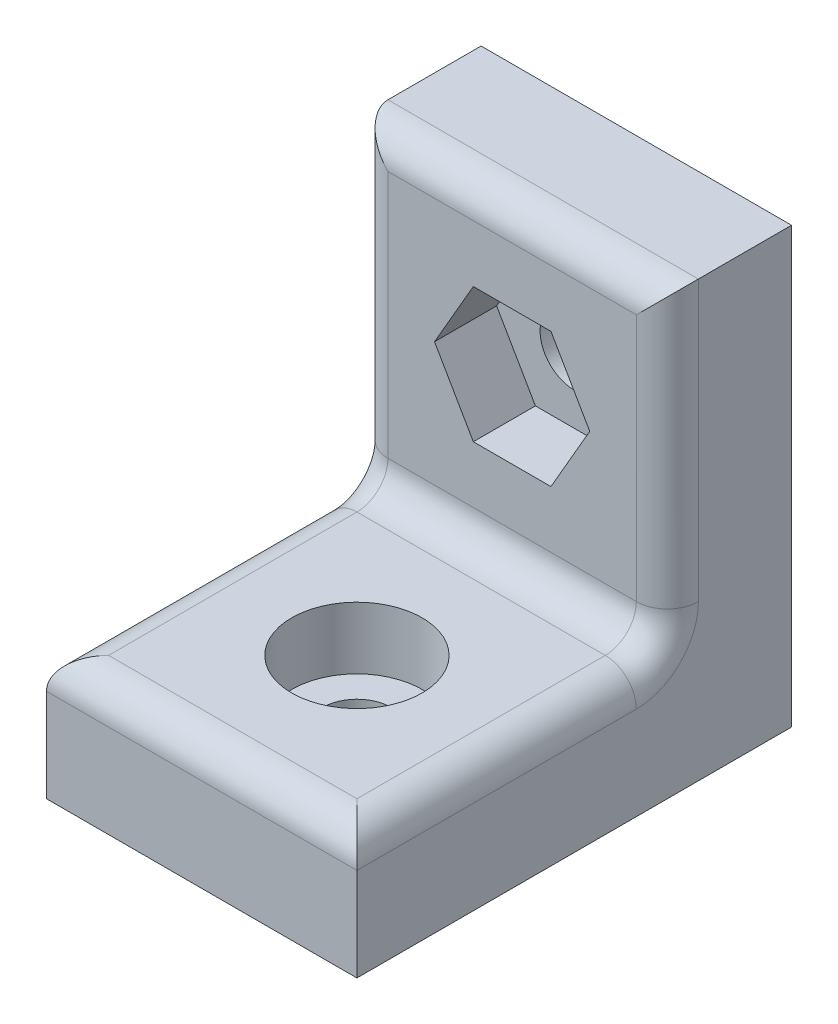
ISO-10303-21;
HEADER;
FILE_DESCRIPTION(('STEP AP214'),'2;1');
FILE_NAME('part.step','',(''),(''),'','','');
FILE_SCHEMA(('AUTOMOTIVE_DESIGN { 1 0 10303 214 1 1 1 1 }'));
ENDSEC;
DATA;
#1=APPLICATION_CONTEXT('core data for automotive mechanical design processes');
#2=APPLICATION_PROTOCOL_DEFINITION('international standard','automotive_design',2000,#1);
#3=PRODUCT_CONTEXT('',#1,'mechanical');
#4=PRODUCT('Part','Part','',(#3));
#5=PRODUCT_RELATED_PRODUCT_CATEGORY('part','',(#4));
#6=PRODUCT_DEFINITION_FORMATION('','',#4);
#7=PRODUCT_DEFINITION_CONTEXT('part definition',#1,'design');
#8=PRODUCT_DEFINITION('design','',#6,#7);
#9=PRODUCT_DEFINITION_SHAPE('','',#8);
#10=(LENGTH_UNIT() NAMED_UNIT(*) SI_UNIT(.MILLI.,.METRE.));
#11=(NAMED_UNIT(*) PLANE_ANGLE_UNIT() SI_UNIT($,.RADIAN.));
#12=(NAMED_UNIT(*) SI_UNIT($,.STERADIAN.) SOLID_ANGLE_UNIT());
#13=UNCERTAINTY_MEASURE_WITH_UNIT(LENGTH_MEASURE(1.E-05),#10,'distance_accuracy_value','');
#14=(GEOMETRIC_REPRESENTATION_CONTEXT(3) GLOBAL_UNCERTAINTY_ASSIGNED_CONTEXT((#13)) GLOBAL_UNIT_ASSIGNED_CONTEXT((#10,
#11,#12)) REPRESENTATION_CONTEXT('',''));
#15=CARTESIAN_POINT('',(0.,0.,0.));
#16=DIRECTION('',(0.,0.,1.));
#17=DIRECTION('',(1.,0.,0.));
#18=AXIS2_PLACEMENT_3D('',#15,#16,#17);
#19=CARTESIAN_POINT('',(0.,0.,9.));
#20=DIRECTION('',(0.,1.,0.));
#21=DIRECTION('',(0.,0.,1.));
#22=AXIS2_PLACEMENT_3D('',#19,#20,#21);
#23=CYLINDRICAL_SURFACE('',#22,1.1);
#24=CARTESIAN_POINT('',(0.,0.,9.));
#25=DIRECTION('',(0.,1.,0.));
#26=DIRECTION('',(0.,0.,1.));
#27=AXIS2_PLACEMENT_3D('',#24,#25,#26);
#28=CIRCLE('',#27,1.1);
#29=CARTESIAN_POINT('',(0.,0.,10.1));
#30=VERTEX_POINT('',#29);
#31=EDGE_CURVE('E220',#30,#30,#28,.T.);
#32=ORIENTED_EDGE('',*,*,#31,.F.);
#33=EDGE_LOOP('',(#32));
#34=FACE_BOUND('',#33,.T.);
#35=CARTESIAN_POINT('',(0.,2.,9.));
#36=DIRECTION('',(0.,1.,0.));
#37=DIRECTION('',(0.,0.,1.));
#38=AXIS2_PLACEMENT_3D('',#35,#36,#37);
#39=CIRCLE('',#38,1.1);
#40=CARTESIAN_POINT('',(0.,2.,10.1));
#41=VERTEX_POINT('',#40);
#42=EDGE_CURVE('E44',#41,#41,#39,.F.);
#43=ORIENTED_EDGE('',*,*,#42,.F.);
#44=EDGE_LOOP('',(#43));
#45=FACE_BOUND('',#44,.T.);
#46=ADVANCED_FACE('F40',(#34,#45),#23,.F.);
#47=CARTESIAN_POINT('',(0.,9.,0.));
#48=DIRECTION('',(0.,0.,1.));
#49=DIRECTION('',(1.,0.,0.));
#50=AXIS2_PLACEMENT_3D('',#47,#48,#49);
#51=CYLINDRICAL_SURFACE('',#50,1.1);
#52=CARTESIAN_POINT('',(0.,9.,0.));
#53=DIRECTION('',(0.,0.,1.));
#54=DIRECTION('',(1.,0.,0.));
#55=AXIS2_PLACEMENT_3D('',#52,#53,#54);
#56=CIRCLE('',#55,1.1);
#57=CARTESIAN_POINT('',(1.1,9.,0.));
#58=VERTEX_POINT('',#57);
#59=EDGE_CURVE('E224',#58,#58,#56,.T.);
#60=ORIENTED_EDGE('',*,*,#59,.F.);
#61=EDGE_LOOP('',(#60));
#62=FACE_BOUND('',#61,.T.);
#63=CARTESIAN_POINT('',(0.,9.,2.));
#64=DIRECTION('',(0.,0.,1.));
#65=DIRECTION('',(1.,0.,0.));
#66=AXIS2_PLACEMENT_3D('',#63,#64,#65);
#67=CIRCLE('',#66,1.1);
#68=CARTESIAN_POINT('',(1.1,9.,2.));
#69=VERTEX_POINT('',#68);
#70=EDGE_CURVE('E212',#69,#69,#67,.F.);
#71=ORIENTED_EDGE('',*,*,#70,.F.);
#72=EDGE_LOOP('',(#71));
#73=FACE_BOUND('',#72,.T.);
#74=ADVANCED_FACE('F317',(#62,#73),#51,.F.);
#75=CARTESIAN_POINT('',(-5.,14.,4.));
#76=DIRECTION('',(1.,0.,0.));
#77=DIRECTION('',(0.,1.,0.));
#78=AXIS2_PLACEMENT_3D('',#75,#76,#77);
#79=PLANE('',#78);
#80=CARTESIAN_POINT('',(-5.,5.,5.));
#81=DIRECTION('',(1.,0.,0.));
#82=DIRECTION('',(0.,1.,0.));
#83=AXIS2_PLACEMENT_3D('',#80,#81,#82);
#84=CIRCLE('',#83,2.);
#85=CARTESIAN_POINT('',(-5.,5.,3.));
#86=VERTEX_POINT('',#85);
#87=CARTESIAN_POINT('',(-5.,3.,5.));
#88=VERTEX_POINT('',#87);
#89=EDGE_CURVE('E274',#86,#88,#84,.F.);
#90=ORIENTED_EDGE('',*,*,#89,.F.);
#91=DIRECTION('',(0.,-1.,0.));
#92=VECTOR('',#91,1.);
#93=CARTESIAN_POINT('',(-5.,14.,3.));
#94=LINE('',#93,#92);
#95=CARTESIAN_POINT('',(-5.,14.,3.));
#96=VERTEX_POINT('',#95);
#97=EDGE_CURVE('E279',#86,#96,#94,.F.);
#98=ORIENTED_EDGE('',*,*,#97,.T.);
#99=DIRECTION('',(0.,0.,-1.));
#100=VECTOR('',#99,1.);
#101=CARTESIAN_POINT('',(-5.,14.,4.));
#102=LINE('',#101,#100);
#103=CARTESIAN_POINT('',(-5.,14.,0.));
#104=VERTEX_POINT('',#103);
#105=EDGE_CURVE('E247',#96,#104,#102,.T.);
#106=ORIENTED_EDGE('',*,*,#105,.T.);
#107=DIRECTION('',(0.,-1.,0.));
#108=VECTOR('',#107,1.);
#109=CARTESIAN_POINT('',(-5.,14.,0.));
#110=LINE('',#109,#108);
#111=CARTESIAN_POINT('',(-5.,0.,0.));
#112=VERTEX_POINT('',#111);
#113=EDGE_CURVE('E236',#104,#112,#110,.T.);
#114=ORIENTED_EDGE('',*,*,#113,.T.);
#115=DIRECTION('',(0.,0.,-1.));
#116=VECTOR('',#115,1.);
#117=CARTESIAN_POINT('',(-5.,0.,4.));
#118=LINE('',#117,#116);
#119=CARTESIAN_POINT('',(-5.,0.,14.));
#120=VERTEX_POINT('',#119);
#121=EDGE_CURVE('E254',#120,#112,#118,.T.);
#122=ORIENTED_EDGE('',*,*,#121,.F.);
#123=DIRECTION('',(0.,-1.,0.));
#124=VECTOR('',#123,1.);
#125=CARTESIAN_POINT('',(-5.,0.,14.));
#126=LINE('',#125,#124);
#127=CARTESIAN_POINT('',(-5.,3.,14.));
#128=VERTEX_POINT('',#127);
#129=EDGE_CURVE('E227',#128,#120,#126,.T.);
#130=ORIENTED_EDGE('',*,*,#129,.F.);
#131=DIRECTION('',(0.,0.,-1.));
#132=VECTOR('',#131,1.);
#133=CARTESIAN_POINT('',(-5.,3.,4.));
#134=LINE('',#133,#132);
#135=EDGE_CURVE('E277',#128,#88,#134,.T.);
#136=ORIENTED_EDGE('',*,*,#135,.T.);
#137=EDGE_LOOP('',(#90,#98,#106,#114,#122,#130,#136));
#138=FACE_BOUND('',#137,.T.);
#139=ADVANCED_FACE('F319',(#138),#79,.F.);
#140=CARTESIAN_POINT('',(-5.,0.,4.));
#141=DIRECTION('',(0.,1.,0.));
#142=DIRECTION('',(0.,0.,1.));
#143=AXIS2_PLACEMENT_3D('',#140,#141,#142);
#144=PLANE('',#143);
#145=ORIENTED_EDGE('',*,*,#31,.T.);
#146=EDGE_LOOP('',(#145));
#147=FACE_BOUND('',#146,.T.);
#148=DIRECTION('',(1.,0.,0.));
#149=VECTOR('',#148,1.);
#150=CARTESIAN_POINT('',(-5.,0.,0.));
#151=LINE('',#150,#149);
#152=CARTESIAN_POINT('',(5.,0.,0.));
#153=VERTEX_POINT('',#152);
#154=EDGE_CURVE('E239',#112,#153,#151,.T.);
#155=ORIENTED_EDGE('',*,*,#154,.T.);
#156=DIRECTION('',(0.,0.,-1.));
#157=VECTOR('',#156,1.);
#158=CARTESIAN_POINT('',(5.,0.,4.));
#159=LINE('',#158,#157);
#160=CARTESIAN_POINT('',(5.,0.,14.));
#161=VERTEX_POINT('',#160);
#162=EDGE_CURVE('E251',#161,#153,#159,.T.);
#163=ORIENTED_EDGE('',*,*,#162,.F.);
#164=DIRECTION('',(1.,0.,0.));
#165=VECTOR('',#164,1.);
#166=CARTESIAN_POINT('',(-5.,0.,14.));
#167=LINE('',#166,#165);
#168=EDGE_CURVE('E230',#120,#161,#167,.T.);
#169=ORIENTED_EDGE('',*,*,#168,.F.);
#170=ORIENTED_EDGE('',*,*,#121,.T.);
#171=EDGE_LOOP('',(#155,#163,#169,#170));
#172=FACE_BOUND('',#171,.T.);
#173=ADVANCED_FACE('F326',(#147,#172),#144,.F.);
#174=CARTESIAN_POINT('',(5.,14.,4.));
#175=DIRECTION('',(-1.,0.,0.));
#176=DIRECTION('',(0.,-1.,0.));
#177=AXIS2_PLACEMENT_3D('',#174,#175,#176);
#178=PLANE('',#177);
#179=DIRECTION('',(0.,0.,-1.));
#180=VECTOR('',#179,1.);
#181=CARTESIAN_POINT('',(5.,14.,4.));
#182=LINE('',#181,#180);
#183=CARTESIAN_POINT('',(5.,14.,3.));
#184=VERTEX_POINT('',#183);
#185=CARTESIAN_POINT('',(5.,14.,0.));
#186=VERTEX_POINT('',#185);
#187=EDGE_CURVE('E249',#184,#186,#182,.T.);
#188=ORIENTED_EDGE('',*,*,#187,.F.);
#189=DIRECTION('',(0.,1.,0.));
#190=VECTOR('',#189,1.);
#191=CARTESIAN_POINT('',(5.,4.,3.));
#192=LINE('',#191,#190);
#193=CARTESIAN_POINT('',(5.,5.,3.));
#194=VERTEX_POINT('',#193);
#195=EDGE_CURVE('E271',#184,#194,#192,.F.);
#196=ORIENTED_EDGE('',*,*,#195,.T.);
#197=CARTESIAN_POINT('',(5.,5.,5.));
#198=DIRECTION('',(-1.,0.,0.));
#199=DIRECTION('',(0.,-1.,0.));
#200=AXIS2_PLACEMENT_3D('',#197,#198,#199);
#201=CIRCLE('',#200,2.);
#202=CARTESIAN_POINT('',(5.,3.,5.));
#203=VERTEX_POINT('',#202);
#204=EDGE_CURVE('E268',#203,#194,#201,.F.);
#205=ORIENTED_EDGE('',*,*,#204,.F.);
#206=DIRECTION('',(0.,0.,-1.));
#207=VECTOR('',#206,1.);
#208=CARTESIAN_POINT('',(5.,3.,4.));
#209=LINE('',#208,#207);
#210=CARTESIAN_POINT('',(5.,3.,14.));
#211=VERTEX_POINT('',#210);
#212=EDGE_CURVE('E266',#203,#211,#209,.F.);
#213=ORIENTED_EDGE('',*,*,#212,.T.);
#214=DIRECTION('',(0.,1.,0.));
#215=VECTOR('',#214,1.);
#216=CARTESIAN_POINT('',(5.,0.,14.));
#217=LINE('',#216,#215);
#218=EDGE_CURVE('E233',#161,#211,#217,.T.);
#219=ORIENTED_EDGE('',*,*,#218,.F.);
#220=ORIENTED_EDGE('',*,*,#162,.T.);
#221=DIRECTION('',(0.,1.,0.));
#222=VECTOR('',#221,1.);
#223=CARTESIAN_POINT('',(5.,14.,0.));
#224=LINE('',#223,#222);
#225=EDGE_CURVE('E241',#153,#186,#224,.T.);
#226=ORIENTED_EDGE('',*,*,#225,.T.);
#227=EDGE_LOOP('',(#188,#196,#205,#213,#219,#220,#226));
#228=FACE_BOUND('',#227,.T.);
#229=ADVANCED_FACE('F353',(#228),#178,.F.);
#230=CARTESIAN_POINT('',(-5.,14.,4.));
#231=DIRECTION('',(0.,-1.,0.));
#232=DIRECTION('',(0.,0.,-1.));
#233=AXIS2_PLACEMENT_3D('',#230,#231,#232);
#234=PLANE('',#233);
#235=ORIENTED_EDGE('',*,*,#105,.F.);
#236=DIRECTION('',(-1.,0.,0.));
#237=VECTOR('',#236,1.);
#238=CARTESIAN_POINT('',(5.,14.,3.));
#239=LINE('',#238,#237);
#240=EDGE_CURVE('E281',#96,#184,#239,.F.);
#241=ORIENTED_EDGE('',*,*,#240,.T.);
#242=ORIENTED_EDGE('',*,*,#187,.T.);
#243=DIRECTION('',(-1.,0.,0.));
#244=VECTOR('',#243,1.);
#245=CARTESIAN_POINT('',(-5.,14.,0.));
#246=LINE('',#245,#244);
#247=EDGE_CURVE('E244',#186,#104,#246,.T.);
#248=ORIENTED_EDGE('',*,*,#247,.T.);
#249=EDGE_LOOP('',(#235,#241,#242,#248));
#250=FACE_BOUND('',#249,.T.);
#251=ADVANCED_FACE('F346',(#250),#234,.F.);
#252=CARTESIAN_POINT('',(0.,0.,4.));
#253=DIRECTION('',(0.,0.,1.));
#254=DIRECTION('',(1.,0.,0.));
#255=AXIS2_PLACEMENT_3D('',#252,#253,#254);
#256=PLANE('',#255);
#257=DIRECTION('',(1.,0.,0.));
#258=VECTOR('',#257,1.);
#259=CARTESIAN_POINT('',(-1.25,6.8349364905389,4.));
#260=LINE('',#259,#258);
#261=CARTESIAN_POINT('',(-1.25,6.8349364905389,4.));
#262=VERTEX_POINT('',#261);
#263=CARTESIAN_POINT('',(1.25,6.83493649053891,4.));
#264=VERTEX_POINT('',#263);
#265=EDGE_CURVE('E57',#262,#264,#260,.T.);
#266=ORIENTED_EDGE('',*,*,#265,.F.);
#267=DIRECTION('',(0.5,-0.866025403784439,0.));
#268=VECTOR('',#267,1.);
#269=CARTESIAN_POINT('',(-2.5,9.,4.));
#270=LINE('',#269,#268);
#271=CARTESIAN_POINT('',(-2.5,9.,4.));
#272=VERTEX_POINT('',#271);
#273=EDGE_CURVE('E183',#272,#262,#270,.T.);
#274=ORIENTED_EDGE('',*,*,#273,.F.);
#275=DIRECTION('',(-0.5,-0.866025403784438,0.));
#276=VECTOR('',#275,1.);
#277=CARTESIAN_POINT('',(-1.25,11.1650635094611,4.));
#278=LINE('',#277,#276);
#279=CARTESIAN_POINT('',(-1.25,11.1650635094611,4.));
#280=VERTEX_POINT('',#279);
#281=EDGE_CURVE('E186',#280,#272,#278,.T.);
#282=ORIENTED_EDGE('',*,*,#281,.F.);
#283=DIRECTION('',(-1.,0.,0.));
#284=VECTOR('',#283,1.);
#285=CARTESIAN_POINT('',(1.25,11.1650635094611,4.));
#286=LINE('',#285,#284);
#287=CARTESIAN_POINT('',(1.25,11.1650635094611,4.));
#288=VERTEX_POINT('',#287);
#289=EDGE_CURVE('E205',#288,#280,#286,.T.);
#290=ORIENTED_EDGE('',*,*,#289,.F.);
#291=DIRECTION('',(-0.5,0.866025403784439,0.));
#292=VECTOR('',#291,1.);
#293=CARTESIAN_POINT('',(2.5,9.,4.));
#294=LINE('',#293,#292);
#295=CARTESIAN_POINT('',(2.5,9.,4.));
#296=VERTEX_POINT('',#295);
#297=EDGE_CURVE('E202',#296,#288,#294,.T.);
#298=ORIENTED_EDGE('',*,*,#297,.F.);
#299=DIRECTION('',(0.5,0.866025403784439,0.));
#300=VECTOR('',#299,1.);
#301=CARTESIAN_POINT('',(1.25,6.8349364905389,4.));
#302=LINE('',#301,#300);
#303=EDGE_CURVE('E200',#264,#296,#302,.T.);
#304=ORIENTED_EDGE('',*,*,#303,.F.);
#305=EDGE_LOOP('',(#266,#274,#282,#290,#298,#304));
#306=FACE_BOUND('',#305,.T.);
#307=DIRECTION('',(0.,1.,0.));
#308=VECTOR('',#307,1.);
#309=CARTESIAN_POINT('',(4.,14.,4.));
#310=LINE('',#309,#308);
#311=CARTESIAN_POINT('',(4.,5.,4.));
#312=VERTEX_POINT('',#311);
#313=CARTESIAN_POINT('',(4.,13.,4.));
#314=VERTEX_POINT('',#313);
#315=EDGE_CURVE('E261',#312,#314,#310,.T.);
#316=ORIENTED_EDGE('',*,*,#315,.T.);
#317=DIRECTION('',(-1.,0.,0.));
#318=VECTOR('',#317,1.);
#319=CARTESIAN_POINT('',(-5.,13.,4.));
#320=LINE('',#319,#318);
#321=CARTESIAN_POINT('',(-4.,13.,4.));
#322=VERTEX_POINT('',#321);
#323=EDGE_CURVE('E264',#314,#322,#320,.T.);
#324=ORIENTED_EDGE('',*,*,#323,.T.);
#325=DIRECTION('',(0.,-1.,0.));
#326=VECTOR('',#325,1.);
#327=CARTESIAN_POINT('',(-4.,4.,4.));
#328=LINE('',#327,#326);
#329=CARTESIAN_POINT('',(-4.,5.,4.));
#330=VERTEX_POINT('',#329);
#331=EDGE_CURVE('E259',#322,#330,#328,.T.);
#332=ORIENTED_EDGE('',*,*,#331,.T.);
#333=DIRECTION('',(-1.,0.,0.));
#334=VECTOR('',#333,1.);
#335=CARTESIAN_POINT('',(0.,5.,4.));
#336=LINE('',#335,#334);
#337=EDGE_CURVE('E257',#330,#312,#336,.F.);
#338=ORIENTED_EDGE('',*,*,#337,.T.);
#339=EDGE_LOOP('',(#316,#324,#332,#338));
#340=FACE_BOUND('',#339,.T.);
#341=ADVANCED_FACE('F343',(#306,#340),#256,.T.);
#342=CARTESIAN_POINT('',(0.,0.,0.));
#343=DIRECTION('',(0.,0.,1.));
#344=DIRECTION('',(1.,0.,0.));
#345=AXIS2_PLACEMENT_3D('',#342,#343,#344);
#346=PLANE('',#345);
#347=ORIENTED_EDGE('',*,*,#59,.T.);
#348=EDGE_LOOP('',(#347));
#349=FACE_BOUND('',#348,.T.);
#350=ORIENTED_EDGE('',*,*,#113,.F.);
#351=ORIENTED_EDGE('',*,*,#247,.F.);
#352=ORIENTED_EDGE('',*,*,#225,.F.);
#353=ORIENTED_EDGE('',*,*,#154,.F.);
#354=EDGE_LOOP('',(#350,#351,#352,#353));
#355=FACE_BOUND('',#354,.T.);
#356=ADVANCED_FACE('F341',(#349,#355),#346,.F.);
#357=CARTESIAN_POINT('',(-5.,4.,14.));
#358=DIRECTION('',(0.,-1.,0.));
#359=DIRECTION('',(0.,0.,-1.));
#360=AXIS2_PLACEMENT_3D('',#357,#358,#359);
#361=PLANE('',#360);
#362=CARTESIAN_POINT('',(0.,4.,9.));
#363=DIRECTION('',(0.,1.,0.));
#364=DIRECTION('',(0.,0.,1.));
#365=AXIS2_PLACEMENT_3D('',#362,#363,#364);
#366=CIRCLE('',#365,2.1);
#367=CARTESIAN_POINT('',(0.,4.,11.1));
#368=VERTEX_POINT('',#367);
#369=EDGE_CURVE('E189',#368,#368,#366,.T.);
#370=ORIENTED_EDGE('',*,*,#369,.F.);
#371=EDGE_LOOP('',(#370));
#372=FACE_BOUND('',#371,.T.);
#373=DIRECTION('',(0.,0.,-1.));
#374=VECTOR('',#373,1.);
#375=CARTESIAN_POINT('',(-4.,4.,14.));
#376=LINE('',#375,#374);
#377=CARTESIAN_POINT('',(-4.,4.,5.));
#378=VERTEX_POINT('',#377);
#379=CARTESIAN_POINT('',(-4.,4.,13.));
#380=VERTEX_POINT('',#379);
#381=EDGE_CURVE('E287',#378,#380,#376,.F.);
#382=ORIENTED_EDGE('',*,*,#381,.T.);
#383=DIRECTION('',(-1.,0.,0.));
#384=VECTOR('',#383,1.);
#385=CARTESIAN_POINT('',(-5.,4.,13.));
#386=LINE('',#385,#384);
#387=CARTESIAN_POINT('',(4.,4.,13.));
#388=VERTEX_POINT('',#387);
#389=EDGE_CURVE('E12',#380,#388,#386,.F.);
#390=ORIENTED_EDGE('',*,*,#389,.T.);
#391=DIRECTION('',(0.,0.,-1.));
#392=VECTOR('',#391,1.);
#393=CARTESIAN_POINT('',(4.,4.,14.));
#394=LINE('',#393,#392);
#395=CARTESIAN_POINT('',(4.,4.,5.));
#396=VERTEX_POINT('',#395);
#397=EDGE_CURVE('E49',#388,#396,#394,.T.);
#398=ORIENTED_EDGE('',*,*,#397,.T.);
#399=DIRECTION('',(-1.,0.,0.));
#400=VECTOR('',#399,1.);
#401=CARTESIAN_POINT('',(-5.,4.,5.));
#402=LINE('',#401,#400);
#403=EDGE_CURVE('E285',#396,#378,#402,.T.);
#404=ORIENTED_EDGE('',*,*,#403,.T.);
#405=EDGE_LOOP('',(#382,#390,#398,#404));
#406=FACE_BOUND('',#405,.T.);
#407=ADVANCED_FACE('F337',(#372,#406),#361,.F.);
#408=CARTESIAN_POINT('',(0.,0.,14.));
#409=DIRECTION('',(0.,0.,-1.));
#410=DIRECTION('',(-1.,0.,0.));
#411=AXIS2_PLACEMENT_3D('',#408,#409,#410);
#412=PLANE('',#411);
#413=ORIENTED_EDGE('',*,*,#218,.T.);
#414=DIRECTION('',(-1.,0.,0.));
#415=VECTOR('',#414,1.);
#416=CARTESIAN_POINT('',(0.,3.,14.));
#417=LINE('',#416,#415);
#418=EDGE_CURVE('E283',#211,#128,#417,.T.);
#419=ORIENTED_EDGE('',*,*,#418,.T.);
#420=ORIENTED_EDGE('',*,*,#129,.T.);
#421=ORIENTED_EDGE('',*,*,#168,.T.);
#422=EDGE_LOOP('',(#413,#419,#420,#421));
#423=FACE_BOUND('',#422,.T.);
#424=ADVANCED_FACE('F334',(#423),#412,.F.);
#425=CARTESIAN_POINT('',(-4.,3.,4.));
#426=DIRECTION('',(0.,0.,-1.));
#427=DIRECTION('',(-1.,0.,0.));
#428=AXIS2_PLACEMENT_3D('',#425,#426,#427);
#429=CYLINDRICAL_SURFACE('',#428,1.);
#430=CARTESIAN_POINT('',(-4.,3.,5.));
#431=DIRECTION('',(0.,0.,-1.));
#432=DIRECTION('',(-1.,0.,0.));
#433=AXIS2_PLACEMENT_3D('',#430,#431,#432);
#434=CIRCLE('',#433,1.);
#435=EDGE_CURVE('E310',#88,#378,#434,.T.);
#436=ORIENTED_EDGE('',*,*,#435,.F.);
#437=ORIENTED_EDGE('',*,*,#135,.F.);
#438=CARTESIAN_POINT('',(-4.,3.,13.));
#439=DIRECTION('',(-0.707106781186547,0.,-0.707106781186547));
#440=DIRECTION('',(0.707106781186547,0.,-0.707106781186547));
#441=AXIS2_PLACEMENT_3D('',#438,#439,#440);
#442=ELLIPSE('',#441,1.41421356237309,1.);
#443=EDGE_CURVE('E228',#380,#128,#442,.F.);
#444=ORIENTED_EDGE('',*,*,#443,.F.);
#445=ORIENTED_EDGE('',*,*,#381,.F.);
#446=EDGE_LOOP('',(#436,#437,#444,#445));
#447=FACE_BOUND('',#446,.T.);
#448=ADVANCED_FACE('F42',(#447),#429,.T.);
#449=CARTESIAN_POINT('',(0.,3.,13.));
#450=DIRECTION('',(-1.,0.,0.));
#451=DIRECTION('',(0.,0.,1.));
#452=AXIS2_PLACEMENT_3D('',#449,#450,#451);
#453=CYLINDRICAL_SURFACE('',#452,1.);
#454=ORIENTED_EDGE('',*,*,#443,.T.);
#455=ORIENTED_EDGE('',*,*,#418,.F.);
#456=CARTESIAN_POINT('',(4.,3.,13.));
#457=DIRECTION('',(0.707106781186547,0.,-0.707106781186547));
#458=DIRECTION('',(-0.707106781186547,0.,-0.707106781186547));
#459=AXIS2_PLACEMENT_3D('',#456,#457,#458);
#460=ELLIPSE('',#459,1.41421356237309,1.);
#461=EDGE_CURVE('E308',#388,#211,#460,.T.);
#462=ORIENTED_EDGE('',*,*,#461,.F.);
#463=ORIENTED_EDGE('',*,*,#389,.F.);
#464=EDGE_LOOP('',(#454,#455,#462,#463));
#465=FACE_BOUND('',#464,.T.);
#466=ADVANCED_FACE('F386',(#465),#453,.T.);
#467=CARTESIAN_POINT('',(-4.,5.,5.));
#468=DIRECTION('',(1.,0.,0.));
#469=DIRECTION('',(0.,1.,0.));
#470=AXIS2_PLACEMENT_3D('',#467,#468,#469);
#471=TOROIDAL_SURFACE('',#470,2.,1.);
#472=ORIENTED_EDGE('',*,*,#89,.T.);
#473=ORIENTED_EDGE('',*,*,#435,.T.);
#474=CARTESIAN_POINT('',(-4.,5.,5.));
#475=DIRECTION('',(1.,0.,0.));
#476=DIRECTION('',(0.,1.,0.));
#477=AXIS2_PLACEMENT_3D('',#474,#475,#476);
#478=CIRCLE('',#477,1.);
#479=EDGE_CURVE('E305',#330,#378,#478,.F.);
#480=ORIENTED_EDGE('',*,*,#479,.F.);
#481=CARTESIAN_POINT('',(-4.,5.,3.));
#482=DIRECTION('',(0.,-1.,0.));
#483=DIRECTION('',(0.,0.,-1.));
#484=AXIS2_PLACEMENT_3D('',#481,#482,#483);
#485=CIRCLE('',#484,1.);
#486=EDGE_CURVE('E302',#86,#330,#485,.F.);
#487=ORIENTED_EDGE('',*,*,#486,.F.);
#488=EDGE_LOOP('',(#472,#473,#480,#487));
#489=FACE_BOUND('',#488,.T.);
#490=ADVANCED_FACE('F384',(#489),#471,.T.);
#491=CARTESIAN_POINT('',(4.,3.,14.));
#492=DIRECTION('',(0.,0.,-1.));
#493=DIRECTION('',(-1.,0.,0.));
#494=AXIS2_PLACEMENT_3D('',#491,#492,#493);
#495=CYLINDRICAL_SURFACE('',#494,1.);
#496=ORIENTED_EDGE('',*,*,#461,.T.);
#497=ORIENTED_EDGE('',*,*,#212,.F.);
#498=CARTESIAN_POINT('',(4.,3.,5.));
#499=DIRECTION('',(0.,0.,-1.));
#500=DIRECTION('',(-1.,0.,0.));
#501=AXIS2_PLACEMENT_3D('',#498,#499,#500);
#502=CIRCLE('',#501,1.);
#503=EDGE_CURVE('E299',#396,#203,#502,.T.);
#504=ORIENTED_EDGE('',*,*,#503,.F.);
#505=ORIENTED_EDGE('',*,*,#397,.F.);
#506=EDGE_LOOP('',(#496,#497,#504,#505));
#507=FACE_BOUND('',#506,.T.);
#508=ADVANCED_FACE('F380',(#507),#495,.T.);
#509=CARTESIAN_POINT('',(-5.,5.,5.));
#510=DIRECTION('',(-1.,0.,0.));
#511=DIRECTION('',(0.,0.,1.));
#512=AXIS2_PLACEMENT_3D('',#509,#510,#511);
#513=CYLINDRICAL_SURFACE('',#512,1.);
#514=ORIENTED_EDGE('',*,*,#479,.T.);
#515=ORIENTED_EDGE('',*,*,#403,.F.);
#516=CARTESIAN_POINT('',(4.,5.,5.));
#517=DIRECTION('',(-1.,0.,0.));
#518=DIRECTION('',(0.,-1.,0.));
#519=AXIS2_PLACEMENT_3D('',#516,#517,#518);
#520=CIRCLE('',#519,1.);
#521=EDGE_CURVE('E296',#312,#396,#520,.T.);
#522=ORIENTED_EDGE('',*,*,#521,.F.);
#523=ORIENTED_EDGE('',*,*,#337,.F.);
#524=EDGE_LOOP('',(#514,#515,#522,#523));
#525=FACE_BOUND('',#524,.T.);
#526=ADVANCED_FACE('F376',(#525),#513,.F.);
#527=CARTESIAN_POINT('',(-4.,0.,3.));
#528=DIRECTION('',(0.,1.,0.));
#529=DIRECTION('',(-1.,0.,0.));
#530=AXIS2_PLACEMENT_3D('',#527,#528,#529);
#531=CYLINDRICAL_SURFACE('',#530,1.);
#532=ORIENTED_EDGE('',*,*,#486,.T.);
#533=ORIENTED_EDGE('',*,*,#331,.F.);
#534=CARTESIAN_POINT('',(-4.,13.,3.));
#535=DIRECTION('',(0.707106781186547,0.707106781186548,0.));
#536=DIRECTION('',(0.707106781186548,-0.707106781186547,0.));
#537=AXIS2_PLACEMENT_3D('',#534,#535,#536);
#538=ELLIPSE('',#537,1.4142135623731,1.);
#539=EDGE_CURVE('E293',#96,#322,#538,.T.);
#540=ORIENTED_EDGE('',*,*,#539,.F.);
#541=ORIENTED_EDGE('',*,*,#97,.F.);
#542=EDGE_LOOP('',(#532,#533,#540,#541));
#543=FACE_BOUND('',#542,.T.);
#544=ADVANCED_FACE('F372',(#543),#531,.T.);
#545=CARTESIAN_POINT('',(4.,5.,5.));
#546=DIRECTION('',(-1.,0.,0.));
#547=DIRECTION('',(0.,-1.,0.));
#548=AXIS2_PLACEMENT_3D('',#545,#546,#547);
#549=TOROIDAL_SURFACE('',#548,2.,1.);
#550=ORIENTED_EDGE('',*,*,#503,.T.);
#551=ORIENTED_EDGE('',*,*,#204,.T.);
#552=CARTESIAN_POINT('',(4.,5.,3.));
#553=DIRECTION('',(0.,-1.,0.));
#554=DIRECTION('',(0.,0.,-1.));
#555=AXIS2_PLACEMENT_3D('',#552,#553,#554);
#556=CIRCLE('',#555,1.);
#557=EDGE_CURVE('E291',#312,#194,#556,.F.);
#558=ORIENTED_EDGE('',*,*,#557,.F.);
#559=ORIENTED_EDGE('',*,*,#521,.T.);
#560=EDGE_LOOP('',(#550,#551,#558,#559));
#561=FACE_BOUND('',#560,.T.);
#562=ADVANCED_FACE('F368',(#561),#549,.T.);
#563=CARTESIAN_POINT('',(0.,13.,3.));
#564=DIRECTION('',(1.,0.,0.));
#565=DIRECTION('',(0.,0.,-1.));
#566=AXIS2_PLACEMENT_3D('',#563,#564,#565);
#567=CYLINDRICAL_SURFACE('',#566,1.);
#568=ORIENTED_EDGE('',*,*,#539,.T.);
#569=ORIENTED_EDGE('',*,*,#323,.F.);
#570=CARTESIAN_POINT('',(4.,13.,3.));
#571=DIRECTION('',(0.707106781186548,-0.707106781186547,0.));
#572=DIRECTION('',(0.707106781186547,0.707106781186548,0.));
#573=AXIS2_PLACEMENT_3D('',#570,#571,#572);
#574=ELLIPSE('',#573,1.41421356237309,1.);
#575=EDGE_CURVE('E223',#184,#314,#574,.T.);
#576=ORIENTED_EDGE('',*,*,#575,.F.);
#577=ORIENTED_EDGE('',*,*,#240,.F.);
#578=EDGE_LOOP('',(#568,#569,#576,#577));
#579=FACE_BOUND('',#578,.T.);
#580=ADVANCED_FACE('F364',(#579),#567,.T.);
#581=CARTESIAN_POINT('',(4.,0.,3.));
#582=DIRECTION('',(0.,-1.,0.));
#583=DIRECTION('',(1.,0.,0.));
#584=AXIS2_PLACEMENT_3D('',#581,#582,#583);
#585=CYLINDRICAL_SURFACE('',#584,1.);
#586=ORIENTED_EDGE('',*,*,#557,.T.);
#587=ORIENTED_EDGE('',*,*,#195,.F.);
#588=ORIENTED_EDGE('',*,*,#575,.T.);
#589=ORIENTED_EDGE('',*,*,#315,.F.);
#590=EDGE_LOOP('',(#586,#587,#588,#589));
#591=FACE_BOUND('',#590,.T.);
#592=ADVANCED_FACE('F361',(#591),#585,.T.);
#593=CARTESIAN_POINT('',(0.,0.,2.));
#594=DIRECTION('',(0.,0.,1.));
#595=DIRECTION('',(1.,0.,0.));
#596=AXIS2_PLACEMENT_3D('',#593,#594,#595);
#597=PLANE('',#596);
#598=DIRECTION('',(1.,0.,0.));
#599=VECTOR('',#598,1.);
#600=CARTESIAN_POINT('',(-1.25,6.8349364905389,2.));
#601=LINE('',#600,#599);
#602=CARTESIAN_POINT('',(-1.25,6.8349364905389,2.));
#603=VERTEX_POINT('',#602);
#604=CARTESIAN_POINT('',(1.25,6.8349364905389,2.));
#605=VERTEX_POINT('',#604);
#606=EDGE_CURVE('E163',#603,#605,#601,.T.);
#607=ORIENTED_EDGE('',*,*,#606,.T.);
#608=DIRECTION('',(0.5,0.866025403784439,0.));
#609=VECTOR('',#608,1.);
#610=CARTESIAN_POINT('',(1.25,6.8349364905389,2.));
#611=LINE('',#610,#609);
#612=CARTESIAN_POINT('',(2.5,9.,2.));
#613=VERTEX_POINT('',#612);
#614=EDGE_CURVE('E172',#605,#613,#611,.T.);
#615=ORIENTED_EDGE('',*,*,#614,.T.);
#616=DIRECTION('',(-0.5,0.866025403784439,0.));
#617=VECTOR('',#616,1.);
#618=CARTESIAN_POINT('',(2.5,9.,2.));
#619=LINE('',#618,#617);
#620=CARTESIAN_POINT('',(1.25,11.1650635094611,2.));
#621=VERTEX_POINT('',#620);
#622=EDGE_CURVE('E177',#613,#621,#619,.T.);
#623=ORIENTED_EDGE('',*,*,#622,.T.);
#624=DIRECTION('',(-1.,0.,0.));
#625=VECTOR('',#624,1.);
#626=CARTESIAN_POINT('',(1.25,11.1650635094611,2.));
#627=LINE('',#626,#625);
#628=CARTESIAN_POINT('',(-1.25,11.1650635094611,2.));
#629=VERTEX_POINT('',#628);
#630=EDGE_CURVE('E193',#621,#629,#627,.T.);
#631=ORIENTED_EDGE('',*,*,#630,.T.);
#632=DIRECTION('',(-0.5,-0.866025403784438,0.));
#633=VECTOR('',#632,1.);
#634=CARTESIAN_POINT('',(-1.25,11.1650635094611,2.));
#635=LINE('',#634,#633);
#636=CARTESIAN_POINT('',(-2.5,9.,2.));
#637=VERTEX_POINT('',#636);
#638=EDGE_CURVE('E196',#629,#637,#635,.T.);
#639=ORIENTED_EDGE('',*,*,#638,.T.);
#640=DIRECTION('',(0.5,-0.866025403784439,0.));
#641=VECTOR('',#640,1.);
#642=CARTESIAN_POINT('',(-2.5,9.,2.));
#643=LINE('',#642,#641);
#644=EDGE_CURVE('E169',#637,#603,#643,.T.);
#645=ORIENTED_EDGE('',*,*,#644,.T.);
#646=EDGE_LOOP('',(#607,#615,#623,#631,#639,#645));
#647=FACE_BOUND('',#646,.T.);
#648=ORIENTED_EDGE('',*,*,#70,.T.);
#649=EDGE_LOOP('',(#648));
#650=FACE_BOUND('',#649,.T.);
#651=ADVANCED_FACE('F179',(#647,#650),#597,.T.);
#652=CARTESIAN_POINT('',(-1.25,6.8349364905389,2.));
#653=DIRECTION('',(0.,-1.,0.));
#654=DIRECTION('',(0.,0.,-1.));
#655=AXIS2_PLACEMENT_3D('',#652,#653,#654);
#656=PLANE('',#655);
#657=ORIENTED_EDGE('',*,*,#265,.T.);
#658=DIRECTION('',(0.,0.,1.));
#659=VECTOR('',#658,1.);
#660=CARTESIAN_POINT('',(1.25,6.8349364905389,2.));
#661=LINE('',#660,#659);
#662=EDGE_CURVE('E159',#605,#264,#661,.T.);
#663=ORIENTED_EDGE('',*,*,#662,.F.);
#664=ORIENTED_EDGE('',*,*,#606,.F.);
#665=DIRECTION('',(0.,0.,1.));
#666=VECTOR('',#665,1.);
#667=CARTESIAN_POINT('',(-1.25,6.8349364905389,2.));
#668=LINE('',#667,#666);
#669=EDGE_CURVE('E210',#603,#262,#668,.T.);
#670=ORIENTED_EDGE('',*,*,#669,.T.);
#671=EDGE_LOOP('',(#657,#663,#664,#670));
#672=FACE_BOUND('',#671,.T.);
#673=ADVANCED_FACE('F161',(#672),#656,.F.);
#674=CARTESIAN_POINT('',(-2.5,9.,2.));
#675=DIRECTION('',(-0.866025403784439,-0.5,0.));
#676=DIRECTION('',(0.5,-0.866025403784439,0.));
#677=AXIS2_PLACEMENT_3D('',#674,#675,#676);
#678=PLANE('',#677);
#679=ORIENTED_EDGE('',*,*,#273,.T.);
#680=ORIENTED_EDGE('',*,*,#669,.F.);
#681=ORIENTED_EDGE('',*,*,#644,.F.);
#682=DIRECTION('',(0.,0.,1.));
#683=VECTOR('',#682,1.);
#684=CARTESIAN_POINT('',(-2.5,9.,2.));
#685=LINE('',#684,#683);
#686=EDGE_CURVE('E213',#637,#272,#685,.T.);
#687=ORIENTED_EDGE('',*,*,#686,.T.);
#688=EDGE_LOOP('',(#679,#680,#681,#687));
#689=FACE_BOUND('',#688,.T.);
#690=ADVANCED_FACE('F549',(#689),#678,.F.);
#691=CARTESIAN_POINT('',(-1.25,11.1650635094611,2.));
#692=DIRECTION('',(-0.866025403784438,0.5,0.));
#693=DIRECTION('',(-0.5,-0.866025403784439,0.));
#694=AXIS2_PLACEMENT_3D('',#691,#692,#693);
#695=PLANE('',#694);
#696=ORIENTED_EDGE('',*,*,#281,.T.);
#697=ORIENTED_EDGE('',*,*,#686,.F.);
#698=ORIENTED_EDGE('',*,*,#638,.F.);
#699=DIRECTION('',(0.,0.,1.));
#700=VECTOR('',#699,1.);
#701=CARTESIAN_POINT('',(-1.25,11.1650635094611,2.));
#702=LINE('',#701,#700);
#703=EDGE_CURVE('E215',#629,#280,#702,.T.);
#704=ORIENTED_EDGE('',*,*,#703,.T.);
#705=EDGE_LOOP('',(#696,#697,#698,#704));
#706=FACE_BOUND('',#705,.T.);
#707=ADVANCED_FACE('F556',(#706),#695,.F.);
#708=CARTESIAN_POINT('',(1.25,11.1650635094611,2.));
#709=DIRECTION('',(0.,1.,0.));
#710=DIRECTION('',(0.,0.,1.));
#711=AXIS2_PLACEMENT_3D('',#708,#709,#710);
#712=PLANE('',#711);
#713=ORIENTED_EDGE('',*,*,#289,.T.);
#714=ORIENTED_EDGE('',*,*,#703,.F.);
#715=ORIENTED_EDGE('',*,*,#630,.F.);
#716=DIRECTION('',(0.,0.,1.));
#717=VECTOR('',#716,1.);
#718=CARTESIAN_POINT('',(1.25,11.1650635094611,2.));
#719=LINE('',#718,#717);
#720=EDGE_CURVE('E217',#621,#288,#719,.T.);
#721=ORIENTED_EDGE('',*,*,#720,.T.);
#722=EDGE_LOOP('',(#713,#714,#715,#721));
#723=FACE_BOUND('',#722,.T.);
#724=ADVANCED_FACE('F565',(#723),#712,.F.);
#725=CARTESIAN_POINT('',(2.5,9.,2.));
#726=DIRECTION('',(0.866025403784439,0.5,0.));
#727=DIRECTION('',(-0.5,0.866025403784439,0.));
#728=AXIS2_PLACEMENT_3D('',#725,#726,#727);
#729=PLANE('',#728);
#730=ORIENTED_EDGE('',*,*,#297,.T.);
#731=ORIENTED_EDGE('',*,*,#720,.F.);
#732=ORIENTED_EDGE('',*,*,#622,.F.);
#733=DIRECTION('',(0.,0.,1.));
#734=VECTOR('',#733,1.);
#735=CARTESIAN_POINT('',(2.5,9.,2.));
#736=LINE('',#735,#734);
#737=EDGE_CURVE('E168',#613,#296,#736,.T.);
#738=ORIENTED_EDGE('',*,*,#737,.T.);
#739=EDGE_LOOP('',(#730,#731,#732,#738));
#740=FACE_BOUND('',#739,.T.);
#741=ADVANCED_FACE('F574',(#740),#729,.F.);
#742=CARTESIAN_POINT('',(1.25,6.8349364905389,2.));
#743=DIRECTION('',(0.866025403784439,-0.5,0.));
#744=DIRECTION('',(0.5,0.866025403784439,0.));
#745=AXIS2_PLACEMENT_3D('',#742,#743,#744);
#746=PLANE('',#745);
#747=ORIENTED_EDGE('',*,*,#303,.T.);
#748=ORIENTED_EDGE('',*,*,#737,.F.);
#749=ORIENTED_EDGE('',*,*,#614,.F.);
#750=ORIENTED_EDGE('',*,*,#662,.T.);
#751=EDGE_LOOP('',(#747,#748,#749,#750));
#752=FACE_BOUND('',#751,.T.);
#753=ADVANCED_FACE('F173',(#752),#746,.F.);
#754=CARTESIAN_POINT('',(0.,2.,9.));
#755=DIRECTION('',(0.,1.,0.));
#756=DIRECTION('',(0.,0.,1.));
#757=AXIS2_PLACEMENT_3D('',#754,#755,#756);
#758=PLANE('',#757);
#759=CARTESIAN_POINT('',(0.,2.,9.));
#760=DIRECTION('',(0.,1.,0.));
#761=DIRECTION('',(0.,0.,1.));
#762=AXIS2_PLACEMENT_3D('',#759,#760,#761);
#763=CIRCLE('',#762,2.1);
#764=CARTESIAN_POINT('',(0.,2.,11.1));
#765=VERTEX_POINT('',#764);
#766=EDGE_CURVE('E632',#765,#765,#763,.T.);
#767=ORIENTED_EDGE('',*,*,#766,.T.);
#768=EDGE_LOOP('',(#767));
#769=FACE_BOUND('',#768,.T.);
#770=ORIENTED_EDGE('',*,*,#42,.T.);
#771=EDGE_LOOP('',(#770));
#772=FACE_BOUND('',#771,.T.);
#773=ADVANCED_FACE('F591',(#769,#772),#758,.T.);
#774=CARTESIAN_POINT('',(0.,2.,9.));
#775=DIRECTION('',(0.,1.,0.));
#776=DIRECTION('',(0.,0.,1.));
#777=AXIS2_PLACEMENT_3D('',#774,#775,#776);
#778=CYLINDRICAL_SURFACE('',#777,2.1);
#779=ORIENTED_EDGE('',*,*,#766,.F.);
#780=EDGE_LOOP('',(#779));
#781=FACE_BOUND('',#780,.T.);
#782=ORIENTED_EDGE('',*,*,#369,.T.);
#783=EDGE_LOOP('',(#782));
#784=FACE_BOUND('',#783,.T.);
#785=ADVANCED_FACE('F602',(#781,#784),#778,.F.);
#786=CLOSED_SHELL('',(#46,#74,#139,#173,#229,#251,#341,#356,#407,#424,#448,#466,#490,#508,#526,
#544,#562,#580,#592,#651,#673,#690,#707,#724,#741,#753,#773,#785));
#787=MANIFOLD_SOLID_BREP('B2',#786);
#788=ADVANCED_BREP_SHAPE_REPRESENTATION('',(#18,#787),#14);
#789=SHAPE_DEFINITION_REPRESENTATION(#9,#788);
ENDSEC;
END-ISO-10303-21;
